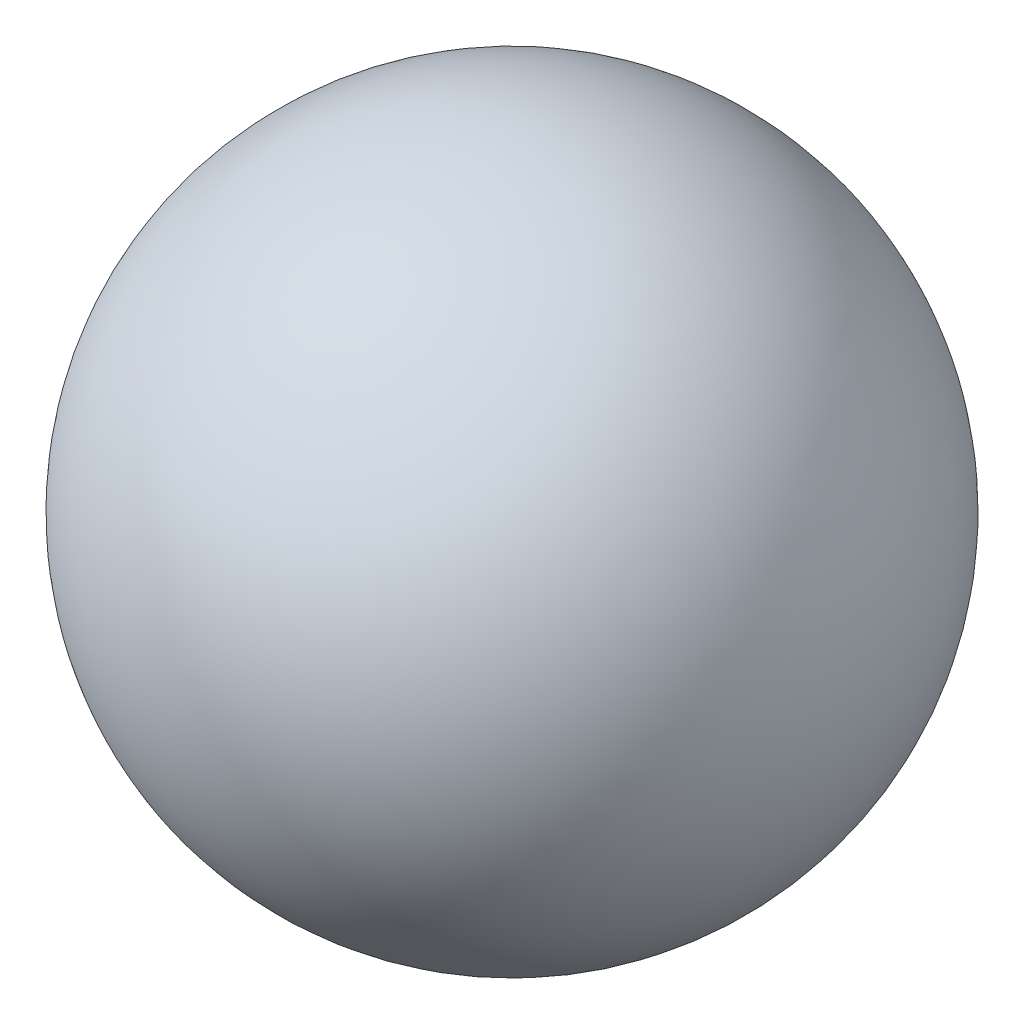
ISO-10303-21;
HEADER;
FILE_DESCRIPTION(('STEP AP214'),'2;1');
FILE_NAME('part.step','',(''),(''),'','','');
FILE_SCHEMA(('AUTOMOTIVE_DESIGN { 1 0 10303 214 1 1 1 1 }'));
ENDSEC;
DATA;
#1=APPLICATION_CONTEXT('core data for automotive mechanical design processes');
#2=APPLICATION_PROTOCOL_DEFINITION('international standard','automotive_design',2000,#1);
#3=PRODUCT_CONTEXT('',#1,'mechanical');
#4=PRODUCT('Part','Part','',(#3));
#5=PRODUCT_RELATED_PRODUCT_CATEGORY('part','',(#4));
#6=PRODUCT_DEFINITION_FORMATION('','',#4);
#7=PRODUCT_DEFINITION_CONTEXT('part definition',#1,'design');
#8=PRODUCT_DEFINITION('design','',#6,#7);
#9=PRODUCT_DEFINITION_SHAPE('','',#8);
#10=(LENGTH_UNIT() NAMED_UNIT(*) SI_UNIT(.MILLI.,.METRE.));
#11=(NAMED_UNIT(*) PLANE_ANGLE_UNIT() SI_UNIT($,.RADIAN.));
#12=(NAMED_UNIT(*) SI_UNIT($,.STERADIAN.) SOLID_ANGLE_UNIT());
#13=UNCERTAINTY_MEASURE_WITH_UNIT(LENGTH_MEASURE(1.E-05),#10,'distance_accuracy_value','');
#14=(GEOMETRIC_REPRESENTATION_CONTEXT(3) GLOBAL_UNCERTAINTY_ASSIGNED_CONTEXT((#13)) GLOBAL_UNIT_ASSIGNED_CONTEXT((#10,
#11,#12)) REPRESENTATION_CONTEXT('',''));
#15=CARTESIAN_POINT('',(0.,0.,0.));
#16=DIRECTION('',(0.,0.,1.));
#17=DIRECTION('',(1.,0.,0.));
#18=AXIS2_PLACEMENT_3D('',#15,#16,#17);
#19=CARTESIAN_POINT('',(-4.32512653964478,-3.,6.73002826264945));
#20=DIRECTION('',(0.,0.,1.));
#21=DIRECTION('',(1.,0.,0.));
#22=AXIS2_PLACEMENT_3D('',#19,#20,#21);
#23=SPHERICAL_SURFACE('',#22,1.8);
#24=CARTESIAN_POINT('',(-4.32512653964478,-3.,8.53002826264945));
#25=VERTEX_POINT('',#24);
#26=VERTEX_LOOP('',#25);
#27=FACE_BOUND('',#26,.T.);
#28=ADVANCED_FACE('F12',(#27),#23,.T.);
#29=CLOSED_SHELL('',(#28));
#30=MANIFOLD_SOLID_BREP('B1',#29);
#31=ADVANCED_BREP_SHAPE_REPRESENTATION('',(#18,#30),#14);
#32=SHAPE_DEFINITION_REPRESENTATION(#9,#31);
ENDSEC;
END-ISO-10303-21;
